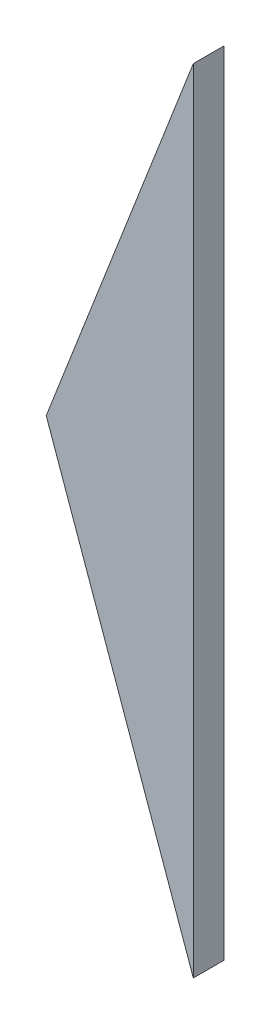
ISO-10303-21;
HEADER;
FILE_DESCRIPTION(('STEP AP214'),'2;1');
FILE_NAME('part.step','',(''),(''),'','','');
FILE_SCHEMA(('AUTOMOTIVE_DESIGN { 1 0 10303 214 1 1 1 1 }'));
ENDSEC;
DATA;
#1=APPLICATION_CONTEXT('core data for automotive mechanical design processes');
#2=APPLICATION_PROTOCOL_DEFINITION('international standard','automotive_design',2000,#1);
#3=PRODUCT_CONTEXT('',#1,'mechanical');
#4=PRODUCT('Part','Part','',(#3));
#5=PRODUCT_RELATED_PRODUCT_CATEGORY('part','',(#4));
#6=PRODUCT_DEFINITION_FORMATION('','',#4);
#7=PRODUCT_DEFINITION_CONTEXT('part definition',#1,'design');
#8=PRODUCT_DEFINITION('design','',#6,#7);
#9=PRODUCT_DEFINITION_SHAPE('','',#8);
#10=(LENGTH_UNIT() NAMED_UNIT(*) SI_UNIT(.MILLI.,.METRE.));
#11=(NAMED_UNIT(*) PLANE_ANGLE_UNIT() SI_UNIT($,.RADIAN.));
#12=(NAMED_UNIT(*) SI_UNIT($,.STERADIAN.) SOLID_ANGLE_UNIT());
#13=UNCERTAINTY_MEASURE_WITH_UNIT(LENGTH_MEASURE(1.E-05),#10,'distance_accuracy_value','');
#14=(GEOMETRIC_REPRESENTATION_CONTEXT(3) GLOBAL_UNCERTAINTY_ASSIGNED_CONTEXT((#13)) GLOBAL_UNIT_ASSIGNED_CONTEXT((#10,
#11,#12)) REPRESENTATION_CONTEXT('',''));
#15=CARTESIAN_POINT('',(0.,0.,0.));
#16=DIRECTION('',(0.,0.,1.));
#17=DIRECTION('',(1.,0.,0.));
#18=AXIS2_PLACEMENT_3D('',#15,#16,#17);
#19=CARTESIAN_POINT('',(-11.2501950510871,-106.952263311844,-3.));
#20=DIRECTION('',(-0.942132692088366,-0.335240198213652,0.));
#21=DIRECTION('',(0.335240198213652,-0.942132692088366,0.));
#22=AXIS2_PLACEMENT_3D('',#19,#20,#21);
#23=PLANE('',#22);
#24=DIRECTION('',(0.335240198213652,-0.942132692088366,0.));
#25=VECTOR('',#24,1.);
#26=CARTESIAN_POINT('',(-11.2501950510871,-106.952263311844,0.));
#27=LINE('',#26,#25);
#28=CARTESIAN_POINT('',(-25.7430664156186,-66.2226372481626,0.));
#29=VERTEX_POINT('',#28);
#30=CARTESIAN_POINT('',(-11.2501950510871,-106.952263311844,0.));
#31=VERTEX_POINT('',#30);
#32=EDGE_CURVE('E85',#29,#31,#27,.T.);
#33=ORIENTED_EDGE('',*,*,#32,.F.);
#34=DIRECTION('',(0.,0.,1.));
#35=VECTOR('',#34,1.);
#36=CARTESIAN_POINT('',(-25.7430664156186,-66.2226372481626,-3.));
#37=LINE('',#36,#35);
#38=CARTESIAN_POINT('',(-25.7430664156186,-66.2226372481626,-3.));
#39=VERTEX_POINT('',#38);
#40=EDGE_CURVE('E11',#39,#29,#37,.T.);
#41=ORIENTED_EDGE('',*,*,#40,.F.);
#42=DIRECTION('',(0.335240198213652,-0.942132692088366,0.));
#43=VECTOR('',#42,1.);
#44=CARTESIAN_POINT('',(-11.2501950510871,-106.952263311844,-3.));
#45=LINE('',#44,#43);
#46=CARTESIAN_POINT('',(-11.2501950510871,-106.952263311844,-3.));
#47=VERTEX_POINT('',#46);
#48=EDGE_CURVE('E77',#39,#47,#45,.T.);
#49=ORIENTED_EDGE('',*,*,#48,.T.);
#50=DIRECTION('',(0.,0.,1.));
#51=VECTOR('',#50,1.);
#52=CARTESIAN_POINT('',(-11.2501950510871,-106.952263311844,-3.));
#53=LINE('',#52,#51);
#54=EDGE_CURVE('E36',#47,#31,#53,.T.);
#55=ORIENTED_EDGE('',*,*,#54,.T.);
#56=EDGE_LOOP('',(#33,#41,#49,#55));
#57=FACE_BOUND('',#56,.T.);
#58=ADVANCED_FACE('F33',(#57),#23,.T.);
#59=CARTESIAN_POINT('',(-25.7430664156186,-66.2226372481626,-3.));
#60=DIRECTION('',(-0.932053069710606,0.362321784113289,0.));
#61=DIRECTION('',(-0.362321784113289,-0.932053069710606,0.));
#62=AXIS2_PLACEMENT_3D('',#59,#60,#61);
#63=PLANE('',#62);
#64=DIRECTION('',(-0.362321784113289,-0.932053069710606,0.));
#65=VECTOR('',#64,1.);
#66=CARTESIAN_POINT('',(-25.7430664156186,-66.2226372481626,0.));
#67=LINE('',#66,#65);
#68=CARTESIAN_POINT('',(-11.2501950510871,-28.9405144597384,0.));
#69=VERTEX_POINT('',#68);
#70=EDGE_CURVE('E79',#69,#29,#67,.T.);
#71=ORIENTED_EDGE('',*,*,#70,.F.);
#72=DIRECTION('',(0.,0.,1.));
#73=VECTOR('',#72,1.);
#74=CARTESIAN_POINT('',(-11.2501950510871,-28.9405144597384,-3.));
#75=LINE('',#74,#73);
#76=CARTESIAN_POINT('',(-11.2501950510871,-28.9405144597384,-3.));
#77=VERTEX_POINT('',#76);
#78=EDGE_CURVE('E42',#77,#69,#75,.T.);
#79=ORIENTED_EDGE('',*,*,#78,.F.);
#80=DIRECTION('',(-0.362321784113289,-0.932053069710606,0.));
#81=VECTOR('',#80,1.);
#82=CARTESIAN_POINT('',(-25.7430664156186,-66.2226372481626,-3.));
#83=LINE('',#82,#81);
#84=EDGE_CURVE('E74',#77,#39,#83,.T.);
#85=ORIENTED_EDGE('',*,*,#84,.T.);
#86=ORIENTED_EDGE('',*,*,#40,.T.);
#87=EDGE_LOOP('',(#71,#79,#85,#86));
#88=FACE_BOUND('',#87,.T.);
#89=ADVANCED_FACE('F89',(#88),#63,.T.);
#90=CARTESIAN_POINT('',(-11.2501950510871,-28.9405144597384,-3.));
#91=DIRECTION('',(1.,0.,0.));
#92=DIRECTION('',(0.,1.,0.));
#93=AXIS2_PLACEMENT_3D('',#90,#91,#92);
#94=PLANE('',#93);
#95=DIRECTION('',(0.,1.,0.));
#96=VECTOR('',#95,1.);
#97=CARTESIAN_POINT('',(-11.2501950510871,-28.9405144597384,0.));
#98=LINE('',#97,#96);
#99=EDGE_CURVE('E72',#31,#69,#98,.T.);
#100=ORIENTED_EDGE('',*,*,#99,.F.);
#101=ORIENTED_EDGE('',*,*,#54,.F.);
#102=DIRECTION('',(0.,1.,0.));
#103=VECTOR('',#102,1.);
#104=CARTESIAN_POINT('',(-11.2501950510871,-28.9405144597384,-3.));
#105=LINE('',#104,#103);
#106=EDGE_CURVE('E70',#47,#77,#105,.T.);
#107=ORIENTED_EDGE('',*,*,#106,.T.);
#108=ORIENTED_EDGE('',*,*,#78,.T.);
#109=EDGE_LOOP('',(#100,#101,#107,#108));
#110=FACE_BOUND('',#109,.T.);
#111=ADVANCED_FACE('F69',(#110),#94,.T.);
#112=CARTESIAN_POINT('',(0.,0.,-3.));
#113=DIRECTION('',(0.,0.,-1.));
#114=DIRECTION('',(-1.,0.,0.));
#115=AXIS2_PLACEMENT_3D('',#112,#113,#114);
#116=PLANE('',#115);
#117=ORIENTED_EDGE('',*,*,#48,.F.);
#118=ORIENTED_EDGE('',*,*,#84,.F.);
#119=ORIENTED_EDGE('',*,*,#106,.F.);
#120=EDGE_LOOP('',(#117,#118,#119));
#121=FACE_BOUND('',#120,.T.);
#122=ADVANCED_FACE('F76',(#121),#116,.T.);
#123=CARTESIAN_POINT('',(0.,0.,0.));
#124=DIRECTION('',(0.,0.,-1.));
#125=DIRECTION('',(-1.,0.,0.));
#126=AXIS2_PLACEMENT_3D('',#123,#124,#125);
#127=PLANE('',#126);
#128=ORIENTED_EDGE('',*,*,#32,.T.);
#129=ORIENTED_EDGE('',*,*,#99,.T.);
#130=ORIENTED_EDGE('',*,*,#70,.T.);
#131=EDGE_LOOP('',(#128,#129,#130));
#132=FACE_BOUND('',#131,.T.);
#133=ADVANCED_FACE('F88',(#132),#127,.F.);
#134=CLOSED_SHELL('',(#58,#89,#111,#122,#133));
#135=MANIFOLD_SOLID_BREP('B2',#134);
#136=ADVANCED_BREP_SHAPE_REPRESENTATION('',(#18,#135),#14);
#137=SHAPE_DEFINITION_REPRESENTATION(#9,#136);
ENDSEC;
END-ISO-10303-21;
